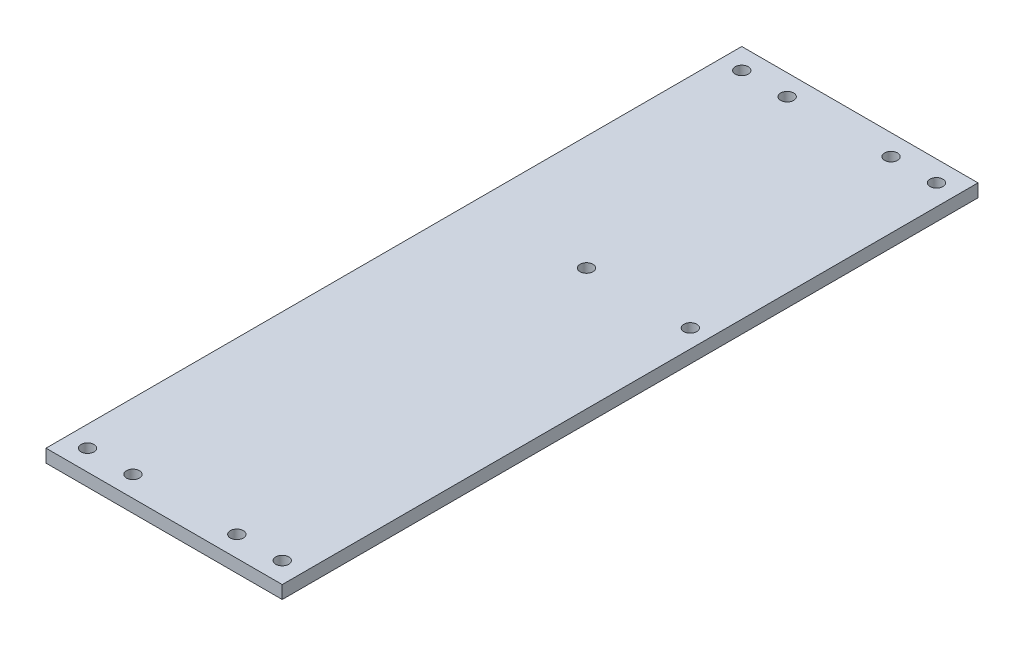
ISO-10303-21;
HEADER;
FILE_DESCRIPTION(('STEP AP214'),'2;1');
FILE_NAME('part.step','',(''),(''),'','','');
FILE_SCHEMA(('AUTOMOTIVE_DESIGN { 1 0 10303 214 1 1 1 1 }'));
ENDSEC;
DATA;
#1=APPLICATION_CONTEXT('core data for automotive mechanical design processes');
#2=APPLICATION_PROTOCOL_DEFINITION('international standard','automotive_design',2000,#1);
#3=PRODUCT_CONTEXT('',#1,'mechanical');
#4=PRODUCT('Part','Part','',(#3));
#5=PRODUCT_RELATED_PRODUCT_CATEGORY('part','',(#4));
#6=PRODUCT_DEFINITION_FORMATION('','',#4);
#7=PRODUCT_DEFINITION_CONTEXT('part definition',#1,'design');
#8=PRODUCT_DEFINITION('design','',#6,#7);
#9=PRODUCT_DEFINITION_SHAPE('','',#8);
#10=(LENGTH_UNIT() NAMED_UNIT(*) SI_UNIT(.MILLI.,.METRE.));
#11=(NAMED_UNIT(*) PLANE_ANGLE_UNIT() SI_UNIT($,.RADIAN.));
#12=(NAMED_UNIT(*) SI_UNIT($,.STERADIAN.) SOLID_ANGLE_UNIT());
#13=UNCERTAINTY_MEASURE_WITH_UNIT(LENGTH_MEASURE(1.E-05),#10,'distance_accuracy_value','');
#14=(GEOMETRIC_REPRESENTATION_CONTEXT(3) GLOBAL_UNCERTAINTY_ASSIGNED_CONTEXT((#13)) GLOBAL_UNIT_ASSIGNED_CONTEXT((#10,
#11,#12)) REPRESENTATION_CONTEXT('',''));
#15=CARTESIAN_POINT('',(0.,0.,0.));
#16=DIRECTION('',(0.,0.,1.));
#17=DIRECTION('',(1.,0.,0.));
#18=AXIS2_PLACEMENT_3D('',#15,#16,#17);
#19=CARTESIAN_POINT('',(0.,5.,0.));
#20=DIRECTION('',(0.,-1.,0.));
#21=DIRECTION('',(0.,0.,-1.));
#22=AXIS2_PLACEMENT_3D('',#19,#20,#21);
#23=PLANE('',#22);
#24=CARTESIAN_POINT('',(28.25,5.,126.));
#25=DIRECTION('',(0.,1.,0.));
#26=DIRECTION('',(0.,0.,1.));
#27=AXIS2_PLACEMENT_3D('',#24,#25,#26);
#28=CIRCLE('',#27,2.5);
#29=CARTESIAN_POINT('',(28.25,5.,128.5));
#30=VERTEX_POINT('',#29);
#31=EDGE_CURVE('E208',#30,#30,#28,.T.);
#32=ORIENTED_EDGE('',*,*,#31,.F.);
#33=EDGE_LOOP('',(#32));
#34=FACE_BOUND('',#33,.T.);
#35=CARTESIAN_POINT('',(28.25,5.,-126.));
#36=DIRECTION('',(0.,1.,0.));
#37=DIRECTION('',(0.,0.,1.));
#38=AXIS2_PLACEMENT_3D('',#35,#36,#37);
#39=CIRCLE('',#38,2.5);
#40=CARTESIAN_POINT('',(28.25,5.,-123.5));
#41=VERTEX_POINT('',#40);
#42=EDGE_CURVE('E218',#41,#41,#39,.T.);
#43=ORIENTED_EDGE('',*,*,#42,.F.);
#44=EDGE_LOOP('',(#43));
#45=FACE_BOUND('',#44,.T.);
#46=CARTESIAN_POINT('',(-46.75,5.,-126.));
#47=DIRECTION('',(0.,1.,0.));
#48=DIRECTION('',(0.,0.,1.));
#49=AXIS2_PLACEMENT_3D('',#46,#47,#48);
#50=CIRCLE('',#49,2.5);
#51=CARTESIAN_POINT('',(-46.75,5.,-123.5));
#52=VERTEX_POINT('',#51);
#53=EDGE_CURVE('E111',#52,#52,#50,.T.);
#54=ORIENTED_EDGE('',*,*,#53,.F.);
#55=EDGE_LOOP('',(#54));
#56=FACE_BOUND('',#55,.T.);
#57=CARTESIAN_POINT('',(-29.25,5.,126.));
#58=DIRECTION('',(0.,1.,0.));
#59=DIRECTION('',(0.,0.,1.));
#60=AXIS2_PLACEMENT_3D('',#57,#58,#59);
#61=CIRCLE('',#60,2.5);
#62=CARTESIAN_POINT('',(-29.25,5.,128.5));
#63=VERTEX_POINT('',#62);
#64=EDGE_CURVE('E135',#63,#63,#61,.T.);
#65=ORIENTED_EDGE('',*,*,#64,.F.);
#66=EDGE_LOOP('',(#65));
#67=FACE_BOUND('',#66,.T.);
#68=DIRECTION('',(0.,0.,-1.));
#69=VECTOR('',#68,1.);
#70=CARTESIAN_POINT('',(36.25,5.,134.));
#71=LINE('',#70,#69);
#72=CARTESIAN_POINT('',(36.25,5.,134.));
#73=VERTEX_POINT('',#72);
#74=CARTESIAN_POINT('',(36.25,5.,-134.));
#75=VERTEX_POINT('',#74);
#76=EDGE_CURVE('E167',#73,#75,#71,.T.);
#77=ORIENTED_EDGE('',*,*,#76,.T.);
#78=DIRECTION('',(-1.,0.,0.));
#79=VECTOR('',#78,1.);
#80=CARTESIAN_POINT('',(-36.25,5.,-134.));
#81=LINE('',#80,#79);
#82=CARTESIAN_POINT('',(-54.75,5.,-134.));
#83=VERTEX_POINT('',#82);
#84=EDGE_CURVE('E75',#75,#83,#81,.T.);
#85=ORIENTED_EDGE('',*,*,#84,.T.);
#86=DIRECTION('',(0.,0.,-1.));
#87=VECTOR('',#86,1.);
#88=CARTESIAN_POINT('',(-54.75,5.,134.));
#89=LINE('',#88,#87);
#90=CARTESIAN_POINT('',(-54.75,5.,134.));
#91=VERTEX_POINT('',#90);
#92=EDGE_CURVE('E104',#91,#83,#89,.T.);
#93=ORIENTED_EDGE('',*,*,#92,.F.);
#94=DIRECTION('',(1.,0.,0.));
#95=VECTOR('',#94,1.);
#96=CARTESIAN_POINT('',(-36.25,5.,134.));
#97=LINE('',#96,#95);
#98=EDGE_CURVE('E59',#91,#73,#97,.T.);
#99=ORIENTED_EDGE('',*,*,#98,.T.);
#100=EDGE_LOOP('',(#77,#85,#93,#99));
#101=FACE_BOUND('',#100,.T.);
#102=CARTESIAN_POINT('',(10.75,5.,-126.));
#103=DIRECTION('',(0.,1.,0.));
#104=DIRECTION('',(0.,0.,1.));
#105=AXIS2_PLACEMENT_3D('',#102,#103,#104);
#106=CIRCLE('',#105,2.5);
#107=CARTESIAN_POINT('',(10.75,5.,-123.5));
#108=VERTEX_POINT('',#107);
#109=EDGE_CURVE('E159',#108,#108,#106,.T.);
#110=ORIENTED_EDGE('',*,*,#109,.F.);
#111=EDGE_LOOP('',(#110));
#112=FACE_BOUND('',#111,.T.);
#113=CARTESIAN_POINT('',(-29.25,5.,-126.));
#114=DIRECTION('',(0.,1.,0.));
#115=DIRECTION('',(0.,0.,1.));
#116=AXIS2_PLACEMENT_3D('',#113,#114,#115);
#117=CIRCLE('',#116,2.5);
#118=CARTESIAN_POINT('',(-29.25,5.,-123.5));
#119=VERTEX_POINT('',#118);
#120=EDGE_CURVE('E151',#119,#119,#117,.T.);
#121=ORIENTED_EDGE('',*,*,#120,.F.);
#122=EDGE_LOOP('',(#121));
#123=FACE_BOUND('',#122,.T.);
#124=CARTESIAN_POINT('',(10.75,5.,126.));
#125=DIRECTION('',(0.,1.,0.));
#126=DIRECTION('',(0.,0.,1.));
#127=AXIS2_PLACEMENT_3D('',#124,#125,#126);
#128=CIRCLE('',#127,2.5);
#129=CARTESIAN_POINT('',(10.75,5.,128.5));
#130=VERTEX_POINT('',#129);
#131=EDGE_CURVE('E143',#130,#130,#128,.T.);
#132=ORIENTED_EDGE('',*,*,#131,.F.);
#133=EDGE_LOOP('',(#132));
#134=FACE_BOUND('',#133,.T.);
#135=CARTESIAN_POINT('',(29.25,5.,-30.2000000000001));
#136=DIRECTION('',(0.,1.,0.));
#137=DIRECTION('',(0.,0.,1.));
#138=AXIS2_PLACEMENT_3D('',#135,#136,#137);
#139=CIRCLE('',#138,2.5);
#140=CARTESIAN_POINT('',(29.25,5.,-27.7000000000001));
#141=VERTEX_POINT('',#140);
#142=EDGE_CURVE('E127',#141,#141,#139,.T.);
#143=ORIENTED_EDGE('',*,*,#142,.F.);
#144=EDGE_LOOP('',(#143));
#145=FACE_BOUND('',#144,.T.);
#146=CARTESIAN_POINT('',(-10.75,5.,-30.2000000000001));
#147=DIRECTION('',(0.,1.,0.));
#148=DIRECTION('',(0.,0.,1.));
#149=AXIS2_PLACEMENT_3D('',#146,#147,#148);
#150=CIRCLE('',#149,2.5);
#151=CARTESIAN_POINT('',(-10.75,5.,-27.7000000000001));
#152=VERTEX_POINT('',#151);
#153=EDGE_CURVE('E119',#152,#152,#150,.T.);
#154=ORIENTED_EDGE('',*,*,#153,.F.);
#155=EDGE_LOOP('',(#154));
#156=FACE_BOUND('',#155,.T.);
#157=CARTESIAN_POINT('',(-46.75,5.,126.));
#158=DIRECTION('',(0.,1.,0.));
#159=DIRECTION('',(0.,0.,1.));
#160=AXIS2_PLACEMENT_3D('',#157,#158,#159);
#161=CIRCLE('',#160,2.5);
#162=CARTESIAN_POINT('',(-46.75,5.,128.5));
#163=VERTEX_POINT('',#162);
#164=EDGE_CURVE('E200',#163,#163,#161,.T.);
#165=ORIENTED_EDGE('',*,*,#164,.F.);
#166=EDGE_LOOP('',(#165));
#167=FACE_BOUND('',#166,.T.);
#168=ADVANCED_FACE('F41',(#34,#45,#56,#67,#101,#112,#123,#134,#145,#156,#167),#23,.F.);
#169=CARTESIAN_POINT('',(36.25,5.,134.));
#170=DIRECTION('',(-1.,0.,0.));
#171=DIRECTION('',(0.,0.,1.));
#172=AXIS2_PLACEMENT_3D('',#169,#170,#171);
#173=PLANE('',#172);
#174=DIRECTION('',(0.,0.,-1.));
#175=VECTOR('',#174,1.);
#176=CARTESIAN_POINT('',(36.25,0.,134.));
#177=LINE('',#176,#175);
#178=CARTESIAN_POINT('',(36.25,0.,134.));
#179=VERTEX_POINT('',#178);
#180=CARTESIAN_POINT('',(36.25,0.,-134.));
#181=VERTEX_POINT('',#180);
#182=EDGE_CURVE('E92',#179,#181,#177,.T.);
#183=ORIENTED_EDGE('',*,*,#182,.T.);
#184=DIRECTION('',(0.,-1.,0.));
#185=VECTOR('',#184,1.);
#186=CARTESIAN_POINT('',(36.25,5.,-134.));
#187=LINE('',#186,#185);
#188=EDGE_CURVE('E11',#75,#181,#187,.T.);
#189=ORIENTED_EDGE('',*,*,#188,.F.);
#190=ORIENTED_EDGE('',*,*,#76,.F.);
#191=DIRECTION('',(0.,-1.,0.));
#192=VECTOR('',#191,1.);
#193=CARTESIAN_POINT('',(36.25,5.,134.));
#194=LINE('',#193,#192);
#195=EDGE_CURVE('E51',#73,#179,#194,.T.);
#196=ORIENTED_EDGE('',*,*,#195,.T.);
#197=EDGE_LOOP('',(#183,#189,#190,#196));
#198=FACE_BOUND('',#197,.T.);
#199=ADVANCED_FACE('F43',(#198),#173,.F.);
#200=CARTESIAN_POINT('',(-36.25,5.,-134.));
#201=DIRECTION('',(0.,0.,1.));
#202=DIRECTION('',(1.,0.,0.));
#203=AXIS2_PLACEMENT_3D('',#200,#201,#202);
#204=PLANE('',#203);
#205=DIRECTION('',(-1.,0.,0.));
#206=VECTOR('',#205,1.);
#207=CARTESIAN_POINT('',(-36.25,0.,-134.));
#208=LINE('',#207,#206);
#209=CARTESIAN_POINT('',(-54.75,0.,-134.));
#210=VERTEX_POINT('',#209);
#211=EDGE_CURVE('E71',#181,#210,#208,.T.);
#212=ORIENTED_EDGE('',*,*,#211,.T.);
#213=DIRECTION('',(0.,-1.,0.));
#214=VECTOR('',#213,1.);
#215=CARTESIAN_POINT('',(-54.75,5.,-134.));
#216=LINE('',#215,#214);
#217=EDGE_CURVE('E87',#83,#210,#216,.T.);
#218=ORIENTED_EDGE('',*,*,#217,.F.);
#219=ORIENTED_EDGE('',*,*,#84,.F.);
#220=ORIENTED_EDGE('',*,*,#188,.T.);
#221=EDGE_LOOP('',(#212,#218,#219,#220));
#222=FACE_BOUND('',#221,.T.);
#223=ADVANCED_FACE('F85',(#222),#204,.F.);
#224=CARTESIAN_POINT('',(-36.25,5.,134.));
#225=DIRECTION('',(0.,0.,-1.));
#226=DIRECTION('',(-1.,0.,0.));
#227=AXIS2_PLACEMENT_3D('',#224,#225,#226);
#228=PLANE('',#227);
#229=DIRECTION('',(1.,0.,0.));
#230=VECTOR('',#229,1.);
#231=CARTESIAN_POINT('',(-36.25,0.,134.));
#232=LINE('',#231,#230);
#233=CARTESIAN_POINT('',(-54.75,0.,134.));
#234=VERTEX_POINT('',#233);
#235=EDGE_CURVE('E91',#234,#179,#232,.T.);
#236=ORIENTED_EDGE('',*,*,#235,.T.);
#237=ORIENTED_EDGE('',*,*,#195,.F.);
#238=ORIENTED_EDGE('',*,*,#98,.F.);
#239=DIRECTION('',(0.,1.,0.));
#240=VECTOR('',#239,1.);
#241=CARTESIAN_POINT('',(-54.75,0.,134.));
#242=LINE('',#241,#240);
#243=EDGE_CURVE('E101',#234,#91,#242,.T.);
#244=ORIENTED_EDGE('',*,*,#243,.F.);
#245=EDGE_LOOP('',(#236,#237,#238,#244));
#246=FACE_BOUND('',#245,.T.);
#247=ADVANCED_FACE('F183',(#246),#228,.F.);
#248=CARTESIAN_POINT('',(0.,0.,0.));
#249=DIRECTION('',(0.,-1.,0.));
#250=DIRECTION('',(0.,0.,-1.));
#251=AXIS2_PLACEMENT_3D('',#248,#249,#250);
#252=PLANE('',#251);
#253=CARTESIAN_POINT('',(-46.75,0.,126.));
#254=DIRECTION('',(0.,-1.,0.));
#255=DIRECTION('',(0.,0.,-1.));
#256=AXIS2_PLACEMENT_3D('',#253,#254,#255);
#257=CIRCLE('',#256,2.5);
#258=CARTESIAN_POINT('',(-46.75,0.,123.5));
#259=VERTEX_POINT('',#258);
#260=EDGE_CURVE('E203',#259,#259,#257,.T.);
#261=ORIENTED_EDGE('',*,*,#260,.F.);
#262=EDGE_LOOP('',(#261));
#263=FACE_BOUND('',#262,.T.);
#264=CARTESIAN_POINT('',(28.25,0.,126.));
#265=DIRECTION('',(0.,-1.,0.));
#266=DIRECTION('',(0.,0.,-1.));
#267=AXIS2_PLACEMENT_3D('',#264,#265,#266);
#268=CIRCLE('',#267,2.5);
#269=CARTESIAN_POINT('',(28.25,0.,123.5));
#270=VERTEX_POINT('',#269);
#271=EDGE_CURVE('E214',#270,#270,#268,.T.);
#272=ORIENTED_EDGE('',*,*,#271,.F.);
#273=EDGE_LOOP('',(#272));
#274=FACE_BOUND('',#273,.T.);
#275=CARTESIAN_POINT('',(28.25,0.,-126.));
#276=DIRECTION('',(0.,-1.,0.));
#277=DIRECTION('',(0.,0.,-1.));
#278=AXIS2_PLACEMENT_3D('',#275,#276,#277);
#279=CIRCLE('',#278,2.5);
#280=CARTESIAN_POINT('',(28.25,0.,-128.5));
#281=VERTEX_POINT('',#280);
#282=EDGE_CURVE('E222',#281,#281,#279,.T.);
#283=ORIENTED_EDGE('',*,*,#282,.F.);
#284=EDGE_LOOP('',(#283));
#285=FACE_BOUND('',#284,.T.);
#286=CARTESIAN_POINT('',(-46.75,0.,-126.));
#287=DIRECTION('',(0.,-1.,0.));
#288=DIRECTION('',(0.,0.,-1.));
#289=AXIS2_PLACEMENT_3D('',#286,#287,#288);
#290=CIRCLE('',#289,2.5);
#291=CARTESIAN_POINT('',(-46.75,0.,-128.5));
#292=VERTEX_POINT('',#291);
#293=EDGE_CURVE('E106',#292,#292,#290,.T.);
#294=ORIENTED_EDGE('',*,*,#293,.F.);
#295=EDGE_LOOP('',(#294));
#296=FACE_BOUND('',#295,.T.);
#297=CARTESIAN_POINT('',(-10.75,0.,-30.2000000000001));
#298=DIRECTION('',(0.,-1.,0.));
#299=DIRECTION('',(0.,0.,-1.));
#300=AXIS2_PLACEMENT_3D('',#297,#298,#299);
#301=CIRCLE('',#300,2.5);
#302=CARTESIAN_POINT('',(-10.75,0.,-32.7000000000001));
#303=VERTEX_POINT('',#302);
#304=EDGE_CURVE('E123',#303,#303,#301,.T.);
#305=ORIENTED_EDGE('',*,*,#304,.F.);
#306=EDGE_LOOP('',(#305));
#307=FACE_BOUND('',#306,.T.);
#308=CARTESIAN_POINT('',(29.25,0.,-30.2000000000001));
#309=DIRECTION('',(0.,-1.,0.));
#310=DIRECTION('',(0.,0.,-1.));
#311=AXIS2_PLACEMENT_3D('',#308,#309,#310);
#312=CIRCLE('',#311,2.5);
#313=CARTESIAN_POINT('',(29.25,0.,-32.7000000000001));
#314=VERTEX_POINT('',#313);
#315=EDGE_CURVE('E131',#314,#314,#312,.T.);
#316=ORIENTED_EDGE('',*,*,#315,.F.);
#317=EDGE_LOOP('',(#316));
#318=FACE_BOUND('',#317,.T.);
#319=CARTESIAN_POINT('',(-29.25,0.,126.));
#320=DIRECTION('',(0.,-1.,0.));
#321=DIRECTION('',(0.,0.,-1.));
#322=AXIS2_PLACEMENT_3D('',#319,#320,#321);
#323=CIRCLE('',#322,2.5);
#324=CARTESIAN_POINT('',(-29.25,0.,123.5));
#325=VERTEX_POINT('',#324);
#326=EDGE_CURVE('E139',#325,#325,#323,.T.);
#327=ORIENTED_EDGE('',*,*,#326,.F.);
#328=EDGE_LOOP('',(#327));
#329=FACE_BOUND('',#328,.T.);
#330=CARTESIAN_POINT('',(10.75,0.,126.));
#331=DIRECTION('',(0.,-1.,0.));
#332=DIRECTION('',(0.,0.,-1.));
#333=AXIS2_PLACEMENT_3D('',#330,#331,#332);
#334=CIRCLE('',#333,2.5);
#335=CARTESIAN_POINT('',(10.75,0.,123.5));
#336=VERTEX_POINT('',#335);
#337=EDGE_CURVE('E147',#336,#336,#334,.T.);
#338=ORIENTED_EDGE('',*,*,#337,.F.);
#339=EDGE_LOOP('',(#338));
#340=FACE_BOUND('',#339,.T.);
#341=CARTESIAN_POINT('',(-29.25,0.,-126.));
#342=DIRECTION('',(0.,-1.,0.));
#343=DIRECTION('',(0.,0.,-1.));
#344=AXIS2_PLACEMENT_3D('',#341,#342,#343);
#345=CIRCLE('',#344,2.5);
#346=CARTESIAN_POINT('',(-29.25,0.,-128.5));
#347=VERTEX_POINT('',#346);
#348=EDGE_CURVE('E155',#347,#347,#345,.T.);
#349=ORIENTED_EDGE('',*,*,#348,.F.);
#350=EDGE_LOOP('',(#349));
#351=FACE_BOUND('',#350,.T.);
#352=CARTESIAN_POINT('',(10.75,0.,-126.));
#353=DIRECTION('',(0.,-1.,0.));
#354=DIRECTION('',(0.,0.,-1.));
#355=AXIS2_PLACEMENT_3D('',#352,#353,#354);
#356=CIRCLE('',#355,2.5);
#357=CARTESIAN_POINT('',(10.75,0.,-128.5));
#358=VERTEX_POINT('',#357);
#359=EDGE_CURVE('E163',#358,#358,#356,.T.);
#360=ORIENTED_EDGE('',*,*,#359,.F.);
#361=EDGE_LOOP('',(#360));
#362=FACE_BOUND('',#361,.T.);
#363=ORIENTED_EDGE('',*,*,#182,.F.);
#364=ORIENTED_EDGE('',*,*,#235,.F.);
#365=DIRECTION('',(0.,0.,1.));
#366=VECTOR('',#365,1.);
#367=CARTESIAN_POINT('',(-54.75,0.,-134.));
#368=LINE('',#367,#366);
#369=EDGE_CURVE('E95',#210,#234,#368,.T.);
#370=ORIENTED_EDGE('',*,*,#369,.F.);
#371=ORIENTED_EDGE('',*,*,#211,.F.);
#372=EDGE_LOOP('',(#363,#364,#370,#371));
#373=FACE_BOUND('',#372,.T.);
#374=ADVANCED_FACE('F96',(#263,#274,#285,#296,#307,#318,#329,#340,#351,#362,#373),#252,.T.);
#375=CARTESIAN_POINT('',(10.75,5.,-126.));
#376=DIRECTION('',(0.,1.,0.));
#377=DIRECTION('',(0.,0.,1.));
#378=AXIS2_PLACEMENT_3D('',#375,#376,#377);
#379=CYLINDRICAL_SURFACE('',#378,2.5);
#380=ORIENTED_EDGE('',*,*,#109,.T.);
#381=EDGE_LOOP('',(#380));
#382=FACE_BOUND('',#381,.T.);
#383=ORIENTED_EDGE('',*,*,#359,.T.);
#384=EDGE_LOOP('',(#383));
#385=FACE_BOUND('',#384,.T.);
#386=ADVANCED_FACE('F246',(#382,#385),#379,.F.);
#387=CARTESIAN_POINT('',(-29.25,5.,-126.));
#388=DIRECTION('',(0.,1.,0.));
#389=DIRECTION('',(0.,0.,1.));
#390=AXIS2_PLACEMENT_3D('',#387,#388,#389);
#391=CYLINDRICAL_SURFACE('',#390,2.5);
#392=ORIENTED_EDGE('',*,*,#120,.T.);
#393=EDGE_LOOP('',(#392));
#394=FACE_BOUND('',#393,.T.);
#395=ORIENTED_EDGE('',*,*,#348,.T.);
#396=EDGE_LOOP('',(#395));
#397=FACE_BOUND('',#396,.T.);
#398=ADVANCED_FACE('F256',(#394,#397),#391,.F.);
#399=CARTESIAN_POINT('',(10.75,5.,126.));
#400=DIRECTION('',(0.,1.,0.));
#401=DIRECTION('',(0.,0.,1.));
#402=AXIS2_PLACEMENT_3D('',#399,#400,#401);
#403=CYLINDRICAL_SURFACE('',#402,2.5);
#404=ORIENTED_EDGE('',*,*,#131,.T.);
#405=EDGE_LOOP('',(#404));
#406=FACE_BOUND('',#405,.T.);
#407=ORIENTED_EDGE('',*,*,#337,.T.);
#408=EDGE_LOOP('',(#407));
#409=FACE_BOUND('',#408,.T.);
#410=ADVANCED_FACE('F240',(#406,#409),#403,.F.);
#411=CARTESIAN_POINT('',(-29.25,5.,126.));
#412=DIRECTION('',(0.,1.,0.));
#413=DIRECTION('',(0.,0.,1.));
#414=AXIS2_PLACEMENT_3D('',#411,#412,#413);
#415=CYLINDRICAL_SURFACE('',#414,2.5);
#416=ORIENTED_EDGE('',*,*,#64,.T.);
#417=EDGE_LOOP('',(#416));
#418=FACE_BOUND('',#417,.T.);
#419=ORIENTED_EDGE('',*,*,#326,.T.);
#420=EDGE_LOOP('',(#419));
#421=FACE_BOUND('',#420,.T.);
#422=ADVANCED_FACE('F236',(#418,#421),#415,.F.);
#423=CARTESIAN_POINT('',(29.25,5.,-30.2000000000001));
#424=DIRECTION('',(0.,1.,0.));
#425=DIRECTION('',(0.,0.,1.));
#426=AXIS2_PLACEMENT_3D('',#423,#424,#425);
#427=CYLINDRICAL_SURFACE('',#426,2.5);
#428=ORIENTED_EDGE('',*,*,#142,.T.);
#429=EDGE_LOOP('',(#428));
#430=FACE_BOUND('',#429,.T.);
#431=ORIENTED_EDGE('',*,*,#315,.T.);
#432=EDGE_LOOP('',(#431));
#433=FACE_BOUND('',#432,.T.);
#434=ADVANCED_FACE('F239',(#430,#433),#427,.F.);
#435=CARTESIAN_POINT('',(-10.75,5.,-30.2000000000001));
#436=DIRECTION('',(0.,1.,0.));
#437=DIRECTION('',(0.,0.,1.));
#438=AXIS2_PLACEMENT_3D('',#435,#436,#437);
#439=CYLINDRICAL_SURFACE('',#438,2.5);
#440=ORIENTED_EDGE('',*,*,#153,.T.);
#441=EDGE_LOOP('',(#440));
#442=FACE_BOUND('',#441,.T.);
#443=ORIENTED_EDGE('',*,*,#304,.T.);
#444=EDGE_LOOP('',(#443));
#445=FACE_BOUND('',#444,.T.);
#446=ADVANCED_FACE('F329',(#442,#445),#439,.F.);
#447=CARTESIAN_POINT('',(-54.75,0.,0.));
#448=DIRECTION('',(-1.,0.,0.));
#449=DIRECTION('',(0.,0.,1.));
#450=AXIS2_PLACEMENT_3D('',#447,#448,#449);
#451=PLANE('',#450);
#452=ORIENTED_EDGE('',*,*,#217,.T.);
#453=ORIENTED_EDGE('',*,*,#369,.T.);
#454=ORIENTED_EDGE('',*,*,#243,.T.);
#455=ORIENTED_EDGE('',*,*,#92,.T.);
#456=EDGE_LOOP('',(#452,#453,#454,#455));
#457=FACE_BOUND('',#456,.T.);
#458=ADVANCED_FACE('F103',(#457),#451,.T.);
#459=CARTESIAN_POINT('',(-46.75,5.,-126.));
#460=DIRECTION('',(0.,1.,0.));
#461=DIRECTION('',(0.,0.,1.));
#462=AXIS2_PLACEMENT_3D('',#459,#460,#461);
#463=CYLINDRICAL_SURFACE('',#462,2.5);
#464=ORIENTED_EDGE('',*,*,#53,.T.);
#465=EDGE_LOOP('',(#464));
#466=FACE_BOUND('',#465,.T.);
#467=ORIENTED_EDGE('',*,*,#293,.T.);
#468=EDGE_LOOP('',(#467));
#469=FACE_BOUND('',#468,.T.);
#470=ADVANCED_FACE('F230',(#466,#469),#463,.F.);
#471=CARTESIAN_POINT('',(28.25,5.,-126.));
#472=DIRECTION('',(0.,1.,0.));
#473=DIRECTION('',(0.,0.,1.));
#474=AXIS2_PLACEMENT_3D('',#471,#472,#473);
#475=CYLINDRICAL_SURFACE('',#474,2.5);
#476=ORIENTED_EDGE('',*,*,#42,.T.);
#477=EDGE_LOOP('',(#476));
#478=FACE_BOUND('',#477,.T.);
#479=ORIENTED_EDGE('',*,*,#282,.T.);
#480=EDGE_LOOP('',(#479));
#481=FACE_BOUND('',#480,.T.);
#482=ADVANCED_FACE('F301',(#478,#481),#475,.F.);
#483=CARTESIAN_POINT('',(28.25,5.,126.));
#484=DIRECTION('',(0.,1.,0.));
#485=DIRECTION('',(0.,0.,1.));
#486=AXIS2_PLACEMENT_3D('',#483,#484,#485);
#487=CYLINDRICAL_SURFACE('',#486,2.5);
#488=ORIENTED_EDGE('',*,*,#31,.T.);
#489=EDGE_LOOP('',(#488));
#490=FACE_BOUND('',#489,.T.);
#491=ORIENTED_EDGE('',*,*,#271,.T.);
#492=EDGE_LOOP('',(#491));
#493=FACE_BOUND('',#492,.T.);
#494=ADVANCED_FACE('F290',(#490,#493),#487,.F.);
#495=CARTESIAN_POINT('',(-46.75,5.,126.));
#496=DIRECTION('',(0.,1.,0.));
#497=DIRECTION('',(0.,0.,1.));
#498=AXIS2_PLACEMENT_3D('',#495,#496,#497);
#499=CYLINDRICAL_SURFACE('',#498,2.5);
#500=ORIENTED_EDGE('',*,*,#164,.T.);
#501=EDGE_LOOP('',(#500));
#502=FACE_BOUND('',#501,.T.);
#503=ORIENTED_EDGE('',*,*,#260,.T.);
#504=EDGE_LOOP('',(#503));
#505=FACE_BOUND('',#504,.T.);
#506=ADVANCED_FACE('F285',(#502,#505),#499,.F.);
#507=CLOSED_SHELL('',(#168,#199,#223,#247,#374,#386,#398,#410,#422,#434,#446,#458,#470,#482,
#494,#506));
#508=MANIFOLD_SOLID_BREP('B2',#507);
#509=ADVANCED_BREP_SHAPE_REPRESENTATION('',(#18,#508),#14);
#510=SHAPE_DEFINITION_REPRESENTATION(#9,#509);
ENDSEC;
END-ISO-10303-21;
